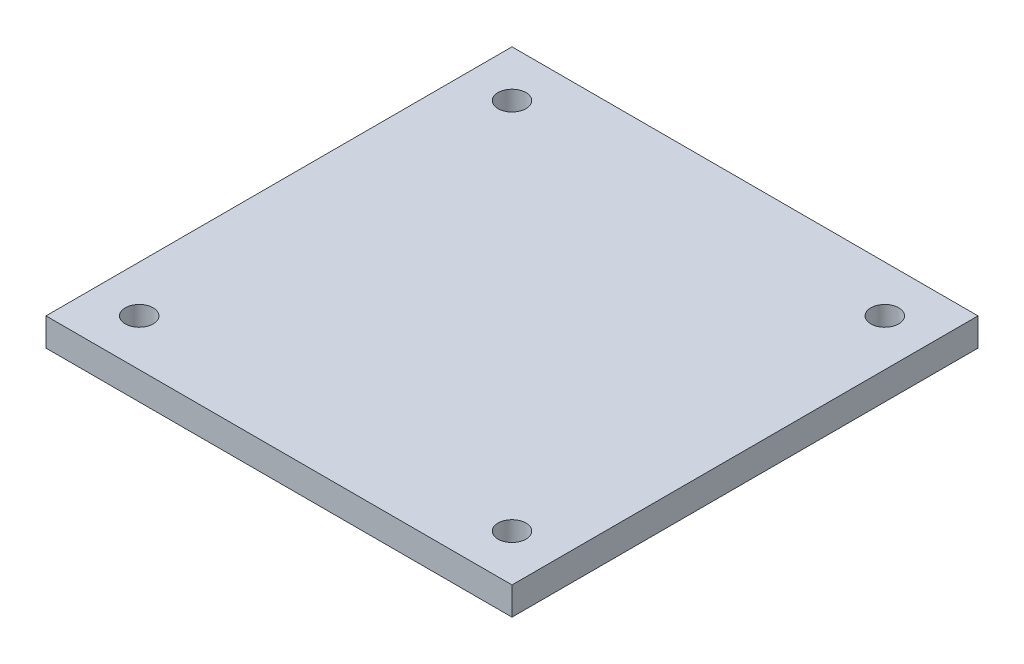
ISO-10303-21;
HEADER;
FILE_DESCRIPTION(('STEP AP214'),'2;1');
FILE_NAME('part.step','',(''),(''),'','','');
FILE_SCHEMA(('AUTOMOTIVE_DESIGN { 1 0 10303 214 1 1 1 1 }'));
ENDSEC;
DATA;
#1=APPLICATION_CONTEXT('core data for automotive mechanical design processes');
#2=APPLICATION_PROTOCOL_DEFINITION('international standard','automotive_design',2000,#1);
#3=PRODUCT_CONTEXT('',#1,'mechanical');
#4=PRODUCT('Part','Part','',(#3));
#5=PRODUCT_RELATED_PRODUCT_CATEGORY('part','',(#4));
#6=PRODUCT_DEFINITION_FORMATION('','',#4);
#7=PRODUCT_DEFINITION_CONTEXT('part definition',#1,'design');
#8=PRODUCT_DEFINITION('design','',#6,#7);
#9=PRODUCT_DEFINITION_SHAPE('','',#8);
#10=(LENGTH_UNIT() NAMED_UNIT(*) SI_UNIT(.MILLI.,.METRE.));
#11=(NAMED_UNIT(*) PLANE_ANGLE_UNIT() SI_UNIT($,.RADIAN.));
#12=(NAMED_UNIT(*) SI_UNIT($,.STERADIAN.) SOLID_ANGLE_UNIT());
#13=UNCERTAINTY_MEASURE_WITH_UNIT(LENGTH_MEASURE(1.E-05),#10,'distance_accuracy_value','');
#14=(GEOMETRIC_REPRESENTATION_CONTEXT(3) GLOBAL_UNCERTAINTY_ASSIGNED_CONTEXT((#13)) GLOBAL_UNIT_ASSIGNED_CONTEXT((#10,
#11,#12)) REPRESENTATION_CONTEXT('',''));
#15=CARTESIAN_POINT('',(0.,0.,0.));
#16=DIRECTION('',(0.,0.,1.));
#17=DIRECTION('',(1.,0.,0.));
#18=AXIS2_PLACEMENT_3D('',#15,#16,#17);
#19=CARTESIAN_POINT('',(0.,3.,0.));
#20=DIRECTION('',(0.,1.,0.));
#21=DIRECTION('',(0.,0.,1.));
#22=AXIS2_PLACEMENT_3D('',#19,#20,#21);
#23=PLANE('',#22);
#24=CARTESIAN_POINT('',(20.,3.,20.));
#25=DIRECTION('',(0.,1.,0.));
#26=DIRECTION('',(0.,0.,-1.));
#27=AXIS2_PLACEMENT_3D('',#24,#25,#26);
#28=CIRCLE('',#27,1.5);
#29=CARTESIAN_POINT('',(20.,3.,18.5));
#30=VERTEX_POINT('',#29);
#31=EDGE_CURVE('E127',#30,#30,#28,.T.);
#32=ORIENTED_EDGE('',*,*,#31,.F.);
#33=EDGE_LOOP('',(#32));
#34=FACE_BOUND('',#33,.T.);
#35=CARTESIAN_POINT('',(20.,3.,-20.));
#36=DIRECTION('',(0.,1.,0.));
#37=DIRECTION('',(0.,0.,1.));
#38=AXIS2_PLACEMENT_3D('',#35,#36,#37);
#39=CIRCLE('',#38,1.5);
#40=CARTESIAN_POINT('',(20.,3.,-18.5));
#41=VERTEX_POINT('',#40);
#42=EDGE_CURVE('E106',#41,#41,#39,.T.);
#43=ORIENTED_EDGE('',*,*,#42,.F.);
#44=EDGE_LOOP('',(#43));
#45=FACE_BOUND('',#44,.T.);
#46=DIRECTION('',(0.,0.,1.));
#47=VECTOR('',#46,1.);
#48=CARTESIAN_POINT('',(-25.,3.,-25.));
#49=LINE('',#48,#47);
#50=CARTESIAN_POINT('',(-25.,3.,-25.));
#51=VERTEX_POINT('',#50);
#52=CARTESIAN_POINT('',(-25.,3.,25.));
#53=VERTEX_POINT('',#52);
#54=EDGE_CURVE('E91',#51,#53,#49,.T.);
#55=ORIENTED_EDGE('',*,*,#54,.T.);
#56=DIRECTION('',(1.,0.,0.));
#57=VECTOR('',#56,1.);
#58=CARTESIAN_POINT('',(-25.,3.,25.));
#59=LINE('',#58,#57);
#60=CARTESIAN_POINT('',(25.,3.,25.));
#61=VERTEX_POINT('',#60);
#62=EDGE_CURVE('E86',#53,#61,#59,.T.);
#63=ORIENTED_EDGE('',*,*,#62,.T.);
#64=DIRECTION('',(0.,0.,-1.));
#65=VECTOR('',#64,1.);
#66=CARTESIAN_POINT('',(25.,3.,-25.));
#67=LINE('',#66,#65);
#68=CARTESIAN_POINT('',(25.,3.,-25.));
#69=VERTEX_POINT('',#68);
#70=EDGE_CURVE('E89',#61,#69,#67,.T.);
#71=ORIENTED_EDGE('',*,*,#70,.T.);
#72=DIRECTION('',(-1.,0.,0.));
#73=VECTOR('',#72,1.);
#74=CARTESIAN_POINT('',(-25.,3.,-25.));
#75=LINE('',#74,#73);
#76=EDGE_CURVE('E56',#69,#51,#75,.T.);
#77=ORIENTED_EDGE('',*,*,#76,.T.);
#78=EDGE_LOOP('',(#55,#63,#71,#77));
#79=FACE_BOUND('',#78,.T.);
#80=CARTESIAN_POINT('',(-20.,3.,-20.));
#81=DIRECTION('',(0.,1.,0.));
#82=DIRECTION('',(0.,0.,-1.));
#83=AXIS2_PLACEMENT_3D('',#80,#81,#82);
#84=CIRCLE('',#83,1.5);
#85=CARTESIAN_POINT('',(-20.,3.,-21.5));
#86=VERTEX_POINT('',#85);
#87=EDGE_CURVE('E121',#86,#86,#84,.T.);
#88=ORIENTED_EDGE('',*,*,#87,.F.);
#89=EDGE_LOOP('',(#88));
#90=FACE_BOUND('',#89,.T.);
#91=CARTESIAN_POINT('',(-20.,3.,20.));
#92=DIRECTION('',(0.,1.,0.));
#93=DIRECTION('',(0.,0.,1.));
#94=AXIS2_PLACEMENT_3D('',#91,#92,#93);
#95=CIRCLE('',#94,1.5);
#96=CARTESIAN_POINT('',(-20.,3.,21.5));
#97=VERTEX_POINT('',#96);
#98=EDGE_CURVE('E133',#97,#97,#95,.T.);
#99=ORIENTED_EDGE('',*,*,#98,.F.);
#100=EDGE_LOOP('',(#99));
#101=FACE_BOUND('',#100,.T.);
#102=ADVANCED_FACE('F39',(#34,#45,#79,#90,#101),#23,.T.);
#103=CARTESIAN_POINT('',(0.,0.,0.));
#104=DIRECTION('',(0.,1.,0.));
#105=DIRECTION('',(0.,0.,1.));
#106=AXIS2_PLACEMENT_3D('',#103,#104,#105);
#107=PLANE('',#106);
#108=DIRECTION('',(0.,0.,1.));
#109=VECTOR('',#108,1.);
#110=CARTESIAN_POINT('',(-25.,0.,-25.));
#111=LINE('',#110,#109);
#112=CARTESIAN_POINT('',(-25.,0.,-25.));
#113=VERTEX_POINT('',#112);
#114=CARTESIAN_POINT('',(-25.,0.,25.));
#115=VERTEX_POINT('',#114);
#116=EDGE_CURVE('E103',#113,#115,#111,.T.);
#117=ORIENTED_EDGE('',*,*,#116,.F.);
#118=DIRECTION('',(-1.,0.,0.));
#119=VECTOR('',#118,1.);
#120=CARTESIAN_POINT('',(-25.,0.,-25.));
#121=LINE('',#120,#119);
#122=CARTESIAN_POINT('',(25.,0.,-25.));
#123=VERTEX_POINT('',#122);
#124=EDGE_CURVE('E79',#123,#113,#121,.T.);
#125=ORIENTED_EDGE('',*,*,#124,.F.);
#126=DIRECTION('',(0.,0.,-1.));
#127=VECTOR('',#126,1.);
#128=CARTESIAN_POINT('',(25.,0.,-25.));
#129=LINE('',#128,#127);
#130=CARTESIAN_POINT('',(25.,0.,25.));
#131=VERTEX_POINT('',#130);
#132=EDGE_CURVE('E73',#131,#123,#129,.T.);
#133=ORIENTED_EDGE('',*,*,#132,.F.);
#134=DIRECTION('',(1.,0.,0.));
#135=VECTOR('',#134,1.);
#136=CARTESIAN_POINT('',(-25.,0.,25.));
#137=LINE('',#136,#135);
#138=EDGE_CURVE('E95',#115,#131,#137,.T.);
#139=ORIENTED_EDGE('',*,*,#138,.F.);
#140=EDGE_LOOP('',(#117,#125,#133,#139));
#141=FACE_BOUND('',#140,.T.);
#142=CARTESIAN_POINT('',(20.,0.,-20.));
#143=DIRECTION('',(0.,1.,0.));
#144=DIRECTION('',(0.,0.,1.));
#145=AXIS2_PLACEMENT_3D('',#142,#143,#144);
#146=CIRCLE('',#145,1.5);
#147=CARTESIAN_POINT('',(20.,0.,-18.5));
#148=VERTEX_POINT('',#147);
#149=EDGE_CURVE('E118',#148,#148,#146,.T.);
#150=ORIENTED_EDGE('',*,*,#149,.T.);
#151=EDGE_LOOP('',(#150));
#152=FACE_BOUND('',#151,.T.);
#153=CARTESIAN_POINT('',(-20.,0.,-20.));
#154=DIRECTION('',(0.,1.,0.));
#155=DIRECTION('',(0.,0.,-1.));
#156=AXIS2_PLACEMENT_3D('',#153,#154,#155);
#157=CIRCLE('',#156,1.5);
#158=CARTESIAN_POINT('',(-20.,0.,-21.5));
#159=VERTEX_POINT('',#158);
#160=EDGE_CURVE('E124',#159,#159,#157,.T.);
#161=ORIENTED_EDGE('',*,*,#160,.T.);
#162=EDGE_LOOP('',(#161));
#163=FACE_BOUND('',#162,.T.);
#164=CARTESIAN_POINT('',(20.,0.,20.));
#165=DIRECTION('',(0.,1.,0.));
#166=DIRECTION('',(0.,0.,-1.));
#167=AXIS2_PLACEMENT_3D('',#164,#165,#166);
#168=CIRCLE('',#167,1.5);
#169=CARTESIAN_POINT('',(20.,0.,18.5));
#170=VERTEX_POINT('',#169);
#171=EDGE_CURVE('E130',#170,#170,#168,.T.);
#172=ORIENTED_EDGE('',*,*,#171,.T.);
#173=EDGE_LOOP('',(#172));
#174=FACE_BOUND('',#173,.T.);
#175=CARTESIAN_POINT('',(-20.,0.,20.));
#176=DIRECTION('',(0.,1.,0.));
#177=DIRECTION('',(0.,0.,1.));
#178=AXIS2_PLACEMENT_3D('',#175,#176,#177);
#179=CIRCLE('',#178,1.5);
#180=CARTESIAN_POINT('',(-20.,0.,21.5));
#181=VERTEX_POINT('',#180);
#182=EDGE_CURVE('E136',#181,#181,#179,.T.);
#183=ORIENTED_EDGE('',*,*,#182,.T.);
#184=EDGE_LOOP('',(#183));
#185=FACE_BOUND('',#184,.T.);
#186=ADVANCED_FACE('F114',(#141,#152,#163,#174,#185),#107,.F.);
#187=CARTESIAN_POINT('',(-25.,3.,-25.));
#188=DIRECTION('',(1.,0.,0.));
#189=DIRECTION('',(0.,0.,-1.));
#190=AXIS2_PLACEMENT_3D('',#187,#188,#189);
#191=PLANE('',#190);
#192=ORIENTED_EDGE('',*,*,#116,.T.);
#193=DIRECTION('',(0.,-1.,0.));
#194=VECTOR('',#193,1.);
#195=CARTESIAN_POINT('',(-25.,3.,25.));
#196=LINE('',#195,#194);
#197=EDGE_CURVE('E11',#53,#115,#196,.T.);
#198=ORIENTED_EDGE('',*,*,#197,.F.);
#199=ORIENTED_EDGE('',*,*,#54,.F.);
#200=DIRECTION('',(0.,-1.,0.));
#201=VECTOR('',#200,1.);
#202=CARTESIAN_POINT('',(-25.,3.,-25.));
#203=LINE('',#202,#201);
#204=EDGE_CURVE('E99',#51,#113,#203,.T.);
#205=ORIENTED_EDGE('',*,*,#204,.T.);
#206=EDGE_LOOP('',(#192,#198,#199,#205));
#207=FACE_BOUND('',#206,.T.);
#208=ADVANCED_FACE('F41',(#207),#191,.F.);
#209=CARTESIAN_POINT('',(-25.,3.,25.));
#210=DIRECTION('',(0.,0.,-1.));
#211=DIRECTION('',(-1.,0.,0.));
#212=AXIS2_PLACEMENT_3D('',#209,#210,#211);
#213=PLANE('',#212);
#214=ORIENTED_EDGE('',*,*,#138,.T.);
#215=DIRECTION('',(0.,-1.,0.));
#216=VECTOR('',#215,1.);
#217=CARTESIAN_POINT('',(25.,3.,25.));
#218=LINE('',#217,#216);
#219=EDGE_CURVE('E48',#61,#131,#218,.T.);
#220=ORIENTED_EDGE('',*,*,#219,.F.);
#221=ORIENTED_EDGE('',*,*,#62,.F.);
#222=ORIENTED_EDGE('',*,*,#197,.T.);
#223=EDGE_LOOP('',(#214,#220,#221,#222));
#224=FACE_BOUND('',#223,.T.);
#225=ADVANCED_FACE('F94',(#224),#213,.F.);
#226=CARTESIAN_POINT('',(25.,3.,-25.));
#227=DIRECTION('',(-1.,0.,0.));
#228=DIRECTION('',(0.,0.,1.));
#229=AXIS2_PLACEMENT_3D('',#226,#227,#228);
#230=PLANE('',#229);
#231=ORIENTED_EDGE('',*,*,#132,.T.);
#232=DIRECTION('',(0.,-1.,0.));
#233=VECTOR('',#232,1.);
#234=CARTESIAN_POINT('',(25.,3.,-25.));
#235=LINE('',#234,#233);
#236=EDGE_CURVE('E96',#69,#123,#235,.T.);
#237=ORIENTED_EDGE('',*,*,#236,.F.);
#238=ORIENTED_EDGE('',*,*,#70,.F.);
#239=ORIENTED_EDGE('',*,*,#219,.T.);
#240=EDGE_LOOP('',(#231,#237,#238,#239));
#241=FACE_BOUND('',#240,.T.);
#242=ADVANCED_FACE('F97',(#241),#230,.F.);
#243=CARTESIAN_POINT('',(-25.,3.,-25.));
#244=DIRECTION('',(0.,0.,1.));
#245=DIRECTION('',(1.,0.,0.));
#246=AXIS2_PLACEMENT_3D('',#243,#244,#245);
#247=PLANE('',#246);
#248=ORIENTED_EDGE('',*,*,#124,.T.);
#249=ORIENTED_EDGE('',*,*,#204,.F.);
#250=ORIENTED_EDGE('',*,*,#76,.F.);
#251=ORIENTED_EDGE('',*,*,#236,.T.);
#252=EDGE_LOOP('',(#248,#249,#250,#251));
#253=FACE_BOUND('',#252,.T.);
#254=ADVANCED_FACE('F111',(#253),#247,.F.);
#255=CARTESIAN_POINT('',(20.,3.,-20.));
#256=DIRECTION('',(0.,-1.,0.));
#257=DIRECTION('',(0.,0.,-1.));
#258=AXIS2_PLACEMENT_3D('',#255,#256,#257);
#259=CYLINDRICAL_SURFACE('',#258,1.5);
#260=ORIENTED_EDGE('',*,*,#42,.T.);
#261=EDGE_LOOP('',(#260));
#262=FACE_BOUND('',#261,.T.);
#263=ORIENTED_EDGE('',*,*,#149,.F.);
#264=EDGE_LOOP('',(#263));
#265=FACE_BOUND('',#264,.T.);
#266=ADVANCED_FACE('F155',(#262,#265),#259,.F.);
#267=CARTESIAN_POINT('',(-20.,3.,-20.));
#268=DIRECTION('',(0.,-1.,0.));
#269=DIRECTION('',(0.,0.,-1.));
#270=AXIS2_PLACEMENT_3D('',#267,#268,#269);
#271=CYLINDRICAL_SURFACE('',#270,1.5);
#272=ORIENTED_EDGE('',*,*,#87,.T.);
#273=EDGE_LOOP('',(#272));
#274=FACE_BOUND('',#273,.T.);
#275=ORIENTED_EDGE('',*,*,#160,.F.);
#276=EDGE_LOOP('',(#275));
#277=FACE_BOUND('',#276,.T.);
#278=ADVANCED_FACE('F209',(#274,#277),#271,.F.);
#279=CARTESIAN_POINT('',(20.,3.,20.));
#280=DIRECTION('',(0.,-1.,0.));
#281=DIRECTION('',(0.,0.,-1.));
#282=AXIS2_PLACEMENT_3D('',#279,#280,#281);
#283=CYLINDRICAL_SURFACE('',#282,1.5);
#284=ORIENTED_EDGE('',*,*,#31,.T.);
#285=EDGE_LOOP('',(#284));
#286=FACE_BOUND('',#285,.T.);
#287=ORIENTED_EDGE('',*,*,#171,.F.);
#288=EDGE_LOOP('',(#287));
#289=FACE_BOUND('',#288,.T.);
#290=ADVANCED_FACE('F218',(#286,#289),#283,.F.);
#291=CARTESIAN_POINT('',(-20.,3.,20.));
#292=DIRECTION('',(0.,-1.,0.));
#293=DIRECTION('',(0.,0.,-1.));
#294=AXIS2_PLACEMENT_3D('',#291,#292,#293);
#295=CYLINDRICAL_SURFACE('',#294,1.5);
#296=ORIENTED_EDGE('',*,*,#98,.T.);
#297=EDGE_LOOP('',(#296));
#298=FACE_BOUND('',#297,.T.);
#299=ORIENTED_EDGE('',*,*,#182,.F.);
#300=EDGE_LOOP('',(#299));
#301=FACE_BOUND('',#300,.T.);
#302=ADVANCED_FACE('F142',(#298,#301),#295,.F.);
#303=CLOSED_SHELL('',(#102,#186,#208,#225,#242,#254,#266,#278,#290,#302));
#304=MANIFOLD_SOLID_BREP('B2',#303);
#305=ADVANCED_BREP_SHAPE_REPRESENTATION('',(#18,#304),#14);
#306=SHAPE_DEFINITION_REPRESENTATION(#9,#305);
ENDSEC;
END-ISO-10303-21;
